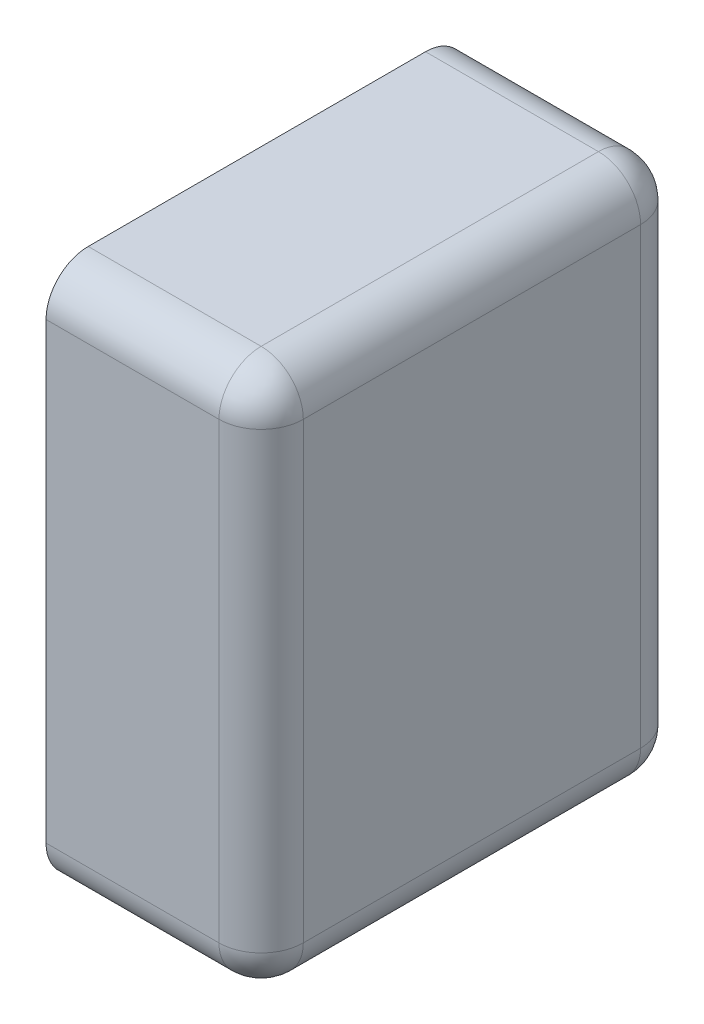
ISO-10303-21;
HEADER;
FILE_DESCRIPTION(('STEP AP214'),'2;1');
FILE_NAME('part.step','',(''),(''),'','','');
FILE_SCHEMA(('AUTOMOTIVE_DESIGN { 1 0 10303 214 1 1 1 1 }'));
ENDSEC;
DATA;
#1=APPLICATION_CONTEXT('core data for automotive mechanical design processes');
#2=APPLICATION_PROTOCOL_DEFINITION('international standard','automotive_design',2000,#1);
#3=PRODUCT_CONTEXT('',#1,'mechanical');
#4=PRODUCT('Part','Part','',(#3));
#5=PRODUCT_RELATED_PRODUCT_CATEGORY('part','',(#4));
#6=PRODUCT_DEFINITION_FORMATION('','',#4);
#7=PRODUCT_DEFINITION_CONTEXT('part definition',#1,'design');
#8=PRODUCT_DEFINITION('design','',#6,#7);
#9=PRODUCT_DEFINITION_SHAPE('','',#8);
#10=(LENGTH_UNIT() NAMED_UNIT(*) SI_UNIT(.MILLI.,.METRE.));
#11=(NAMED_UNIT(*) PLANE_ANGLE_UNIT() SI_UNIT($,.RADIAN.));
#12=(NAMED_UNIT(*) SI_UNIT($,.STERADIAN.) SOLID_ANGLE_UNIT());
#13=UNCERTAINTY_MEASURE_WITH_UNIT(LENGTH_MEASURE(1.E-05),#10,'distance_accuracy_value','');
#14=(GEOMETRIC_REPRESENTATION_CONTEXT(3) GLOBAL_UNCERTAINTY_ASSIGNED_CONTEXT((#13)) GLOBAL_UNIT_ASSIGNED_CONTEXT((#10,
#11,#12)) REPRESENTATION_CONTEXT('',''));
#15=CARTESIAN_POINT('',(0.,0.,0.));
#16=DIRECTION('',(0.,0.,1.));
#17=DIRECTION('',(1.,0.,0.));
#18=AXIS2_PLACEMENT_3D('',#15,#16,#17);
#19=CARTESIAN_POINT('',(0.5,-0.625,0.));
#20=DIRECTION('',(1.,0.,0.));
#21=DIRECTION('',(0.,0.,1.));
#22=AXIS2_PLACEMENT_3D('',#19,#20,#21);
#23=PLANE('',#22);
#24=CARTESIAN_POINT('',(0.5,-0.527,0.882));
#25=DIRECTION('',(-1.,0.,0.));
#26=DIRECTION('',(0.,0.,1.));
#27=AXIS2_PLACEMENT_3D('',#24,#25,#26);
#28=CIRCLE('',#27,0.098);
#29=CARTESIAN_POINT('',(0.5,-0.625,0.882));
#30=VERTEX_POINT('',#29);
#31=CARTESIAN_POINT('',(0.5,-0.527,0.98));
#32=VERTEX_POINT('',#31);
#33=EDGE_CURVE('E11',#30,#32,#28,.T.);
#34=ORIENTED_EDGE('',*,*,#33,.T.);
#35=DIRECTION('',(0.,1.,0.));
#36=VECTOR('',#35,1.);
#37=CARTESIAN_POINT('',(0.5,-0.625,0.98));
#38=LINE('',#37,#36);
#39=CARTESIAN_POINT('',(0.5,0.527,0.98));
#40=VERTEX_POINT('',#39);
#41=EDGE_CURVE('E24',#32,#40,#38,.T.);
#42=ORIENTED_EDGE('',*,*,#41,.T.);
#43=CARTESIAN_POINT('',(0.5,0.527,0.882));
#44=DIRECTION('',(1.,0.,0.));
#45=DIRECTION('',(0.,0.,1.));
#46=AXIS2_PLACEMENT_3D('',#43,#44,#45);
#47=CIRCLE('',#46,0.098);
#48=CARTESIAN_POINT('',(0.5,0.625,0.882));
#49=VERTEX_POINT('',#48);
#50=EDGE_CURVE('E195',#49,#40,#47,.T.);
#51=ORIENTED_EDGE('',*,*,#50,.F.);
#52=DIRECTION('',(0.,0.,1.));
#53=VECTOR('',#52,1.);
#54=CARTESIAN_POINT('',(0.5,0.625,0.));
#55=LINE('',#54,#53);
#56=CARTESIAN_POINT('',(0.5,0.625,0.098));
#57=VERTEX_POINT('',#56);
#58=EDGE_CURVE('E193',#57,#49,#55,.T.);
#59=ORIENTED_EDGE('',*,*,#58,.F.);
#60=CARTESIAN_POINT('',(0.5,0.527,0.098));
#61=DIRECTION('',(-1.,0.,0.));
#62=DIRECTION('',(0.,0.,1.));
#63=AXIS2_PLACEMENT_3D('',#60,#61,#62);
#64=CIRCLE('',#63,0.098);
#65=CARTESIAN_POINT('',(0.5,0.527,0.));
#66=VERTEX_POINT('',#65);
#67=EDGE_CURVE('E190',#57,#66,#64,.T.);
#68=ORIENTED_EDGE('',*,*,#67,.T.);
#69=DIRECTION('',(0.,1.,0.));
#70=VECTOR('',#69,1.);
#71=CARTESIAN_POINT('',(0.5,-0.625,0.));
#72=LINE('',#71,#70);
#73=CARTESIAN_POINT('',(0.5,-0.527,0.));
#74=VERTEX_POINT('',#73);
#75=EDGE_CURVE('E188',#74,#66,#72,.T.);
#76=ORIENTED_EDGE('',*,*,#75,.F.);
#77=CARTESIAN_POINT('',(0.5,-0.527,0.098));
#78=DIRECTION('',(1.,0.,0.));
#79=DIRECTION('',(0.,0.,1.));
#80=AXIS2_PLACEMENT_3D('',#77,#78,#79);
#81=CIRCLE('',#80,0.098);
#82=CARTESIAN_POINT('',(0.5,-0.625,0.098));
#83=VERTEX_POINT('',#82);
#84=EDGE_CURVE('E186',#83,#74,#81,.T.);
#85=ORIENTED_EDGE('',*,*,#84,.F.);
#86=DIRECTION('',(0.,0.,1.));
#87=VECTOR('',#86,1.);
#88=CARTESIAN_POINT('',(0.5,-0.625,0.));
#89=LINE('',#88,#87);
#90=EDGE_CURVE('E36',#83,#30,#89,.T.);
#91=ORIENTED_EDGE('',*,*,#90,.T.);
#92=EDGE_LOOP('',(#34,#42,#51,#59,#68,#76,#85,#91));
#93=FACE_BOUND('',#92,.T.);
#94=ADVANCED_FACE('F17',(#93),#23,.F.);
#95=CARTESIAN_POINT('',(0.5,-0.625,0.));
#96=DIRECTION('',(0.,1.,0.));
#97=DIRECTION('',(0.,0.,1.));
#98=AXIS2_PLACEMENT_3D('',#95,#96,#97);
#99=PLANE('',#98);
#100=DIRECTION('',(1.,0.,0.));
#101=VECTOR('',#100,1.);
#102=CARTESIAN_POINT('',(0.5,-0.625,0.098));
#103=LINE('',#102,#101);
#104=CARTESIAN_POINT('',(0.902,-0.625,0.098));
#105=VERTEX_POINT('',#104);
#106=EDGE_CURVE('E182',#83,#105,#103,.T.);
#107=ORIENTED_EDGE('',*,*,#106,.T.);
#108=DIRECTION('',(0.,0.,1.));
#109=VECTOR('',#108,1.);
#110=CARTESIAN_POINT('',(0.902,-0.625,0.));
#111=LINE('',#110,#109);
#112=CARTESIAN_POINT('',(0.902,-0.625,0.882));
#113=VERTEX_POINT('',#112);
#114=EDGE_CURVE('E179',#105,#113,#111,.T.);
#115=ORIENTED_EDGE('',*,*,#114,.T.);
#116=DIRECTION('',(1.,0.,0.));
#117=VECTOR('',#116,1.);
#118=CARTESIAN_POINT('',(0.5,-0.625,0.882));
#119=LINE('',#118,#117);
#120=EDGE_CURVE('E177',#30,#113,#119,.T.);
#121=ORIENTED_EDGE('',*,*,#120,.F.);
#122=ORIENTED_EDGE('',*,*,#90,.F.);
#123=EDGE_LOOP('',(#107,#115,#121,#122));
#124=FACE_BOUND('',#123,.T.);
#125=ADVANCED_FACE('F227',(#124),#99,.F.);
#126=CARTESIAN_POINT('',(0.5,-0.527,0.098));
#127=DIRECTION('',(1.,0.,0.));
#128=DIRECTION('',(0.,-1.,0.));
#129=AXIS2_PLACEMENT_3D('',#126,#127,#128);
#130=CYLINDRICAL_SURFACE('',#129,0.098);
#131=ORIENTED_EDGE('',*,*,#84,.T.);
#132=DIRECTION('',(1.,0.,0.));
#133=VECTOR('',#132,1.);
#134=CARTESIAN_POINT('',(0.5,-0.527,0.));
#135=LINE('',#134,#133);
#136=CARTESIAN_POINT('',(0.902,-0.527,0.));
#137=VERTEX_POINT('',#136);
#138=EDGE_CURVE('E175',#74,#137,#135,.T.);
#139=ORIENTED_EDGE('',*,*,#138,.T.);
#140=CARTESIAN_POINT('',(0.902,-0.527,0.098));
#141=DIRECTION('',(-1.,0.,0.));
#142=DIRECTION('',(0.,-1.,0.));
#143=AXIS2_PLACEMENT_3D('',#140,#141,#142);
#144=CIRCLE('',#143,0.098);
#145=EDGE_CURVE('E172',#137,#105,#144,.T.);
#146=ORIENTED_EDGE('',*,*,#145,.T.);
#147=ORIENTED_EDGE('',*,*,#106,.F.);
#148=EDGE_LOOP('',(#131,#139,#146,#147));
#149=FACE_BOUND('',#148,.T.);
#150=ADVANCED_FACE('F219',(#149),#130,.T.);
#151=CARTESIAN_POINT('',(0.5,-0.527,0.882));
#152=DIRECTION('',(1.,0.,0.));
#153=DIRECTION('',(0.,-1.,0.));
#154=AXIS2_PLACEMENT_3D('',#151,#152,#153);
#155=CYLINDRICAL_SURFACE('',#154,0.098);
#156=ORIENTED_EDGE('',*,*,#120,.T.);
#157=CARTESIAN_POINT('',(0.902,-0.527,0.882));
#158=DIRECTION('',(1.,0.,0.));
#159=DIRECTION('',(0.,-1.,0.));
#160=AXIS2_PLACEMENT_3D('',#157,#158,#159);
#161=CIRCLE('',#160,0.098);
#162=CARTESIAN_POINT('',(0.902,-0.527,0.98));
#163=VERTEX_POINT('',#162);
#164=EDGE_CURVE('E169',#163,#113,#161,.T.);
#165=ORIENTED_EDGE('',*,*,#164,.F.);
#166=DIRECTION('',(1.,0.,0.));
#167=VECTOR('',#166,1.);
#168=CARTESIAN_POINT('',(0.5,-0.527,0.98));
#169=LINE('',#168,#167);
#170=EDGE_CURVE('E167',#32,#163,#169,.T.);
#171=ORIENTED_EDGE('',*,*,#170,.F.);
#172=ORIENTED_EDGE('',*,*,#33,.F.);
#173=EDGE_LOOP('',(#156,#165,#171,#172));
#174=FACE_BOUND('',#173,.T.);
#175=ADVANCED_FACE('F229',(#174),#155,.T.);
#176=CARTESIAN_POINT('',(0.5,-0.625,0.));
#177=DIRECTION('',(0.,0.,1.));
#178=DIRECTION('',(1.,0.,0.));
#179=AXIS2_PLACEMENT_3D('',#176,#177,#178);
#180=PLANE('',#179);
#181=DIRECTION('',(1.,0.,0.));
#182=VECTOR('',#181,1.);
#183=CARTESIAN_POINT('',(0.5,0.527,0.));
#184=LINE('',#183,#182);
#185=CARTESIAN_POINT('',(0.902,0.527,0.));
#186=VERTEX_POINT('',#185);
#187=EDGE_CURVE('E164',#66,#186,#184,.T.);
#188=ORIENTED_EDGE('',*,*,#187,.T.);
#189=DIRECTION('',(0.,1.,0.));
#190=VECTOR('',#189,1.);
#191=CARTESIAN_POINT('',(0.902,-0.625,0.));
#192=LINE('',#191,#190);
#193=EDGE_CURVE('E162',#137,#186,#192,.T.);
#194=ORIENTED_EDGE('',*,*,#193,.F.);
#195=ORIENTED_EDGE('',*,*,#138,.F.);
#196=ORIENTED_EDGE('',*,*,#75,.T.);
#197=EDGE_LOOP('',(#188,#194,#195,#196));
#198=FACE_BOUND('',#197,.T.);
#199=ADVANCED_FACE('F215',(#198),#180,.F.);
#200=CARTESIAN_POINT('',(0.5,-0.625,0.98));
#201=DIRECTION('',(0.,0.,1.));
#202=DIRECTION('',(1.,0.,0.));
#203=AXIS2_PLACEMENT_3D('',#200,#201,#202);
#204=PLANE('',#203);
#205=ORIENTED_EDGE('',*,*,#41,.F.);
#206=ORIENTED_EDGE('',*,*,#170,.T.);
#207=DIRECTION('',(0.,1.,0.));
#208=VECTOR('',#207,1.);
#209=CARTESIAN_POINT('',(0.902,-0.625,0.98));
#210=LINE('',#209,#208);
#211=CARTESIAN_POINT('',(0.902,0.527,0.98));
#212=VERTEX_POINT('',#211);
#213=EDGE_CURVE('E160',#163,#212,#210,.T.);
#214=ORIENTED_EDGE('',*,*,#213,.T.);
#215=DIRECTION('',(1.,0.,0.));
#216=VECTOR('',#215,1.);
#217=CARTESIAN_POINT('',(0.5,0.527,0.98));
#218=LINE('',#217,#216);
#219=EDGE_CURVE('E157',#40,#212,#218,.T.);
#220=ORIENTED_EDGE('',*,*,#219,.F.);
#221=EDGE_LOOP('',(#205,#206,#214,#220));
#222=FACE_BOUND('',#221,.T.);
#223=ADVANCED_FACE('F200',(#222),#204,.T.);
#224=CARTESIAN_POINT('',(0.5,0.527,0.098));
#225=DIRECTION('',(1.,0.,0.));
#226=DIRECTION('',(0.,1.,0.));
#227=AXIS2_PLACEMENT_3D('',#224,#225,#226);
#228=CYLINDRICAL_SURFACE('',#227,0.098);
#229=DIRECTION('',(1.,0.,0.));
#230=VECTOR('',#229,1.);
#231=CARTESIAN_POINT('',(0.5,0.625,0.098));
#232=LINE('',#231,#230);
#233=CARTESIAN_POINT('',(0.902,0.625,0.098));
#234=VERTEX_POINT('',#233);
#235=EDGE_CURVE('E155',#57,#234,#232,.T.);
#236=ORIENTED_EDGE('',*,*,#235,.T.);
#237=CARTESIAN_POINT('',(0.902,0.527,0.098));
#238=DIRECTION('',(1.,0.,0.));
#239=DIRECTION('',(0.,1.,0.));
#240=AXIS2_PLACEMENT_3D('',#237,#238,#239);
#241=CIRCLE('',#240,0.098);
#242=EDGE_CURVE('E152',#186,#234,#241,.T.);
#243=ORIENTED_EDGE('',*,*,#242,.F.);
#244=ORIENTED_EDGE('',*,*,#187,.F.);
#245=ORIENTED_EDGE('',*,*,#67,.F.);
#246=EDGE_LOOP('',(#236,#243,#244,#245));
#247=FACE_BOUND('',#246,.T.);
#248=ADVANCED_FACE('F211',(#247),#228,.T.);
#249=CARTESIAN_POINT('',(0.5,0.527,0.882));
#250=DIRECTION('',(1.,0.,0.));
#251=DIRECTION('',(0.,1.,0.));
#252=AXIS2_PLACEMENT_3D('',#249,#250,#251);
#253=CYLINDRICAL_SURFACE('',#252,0.098);
#254=ORIENTED_EDGE('',*,*,#50,.T.);
#255=ORIENTED_EDGE('',*,*,#219,.T.);
#256=CARTESIAN_POINT('',(0.902,0.527,0.882));
#257=DIRECTION('',(1.,0.,0.));
#258=DIRECTION('',(0.,0.,1.));
#259=AXIS2_PLACEMENT_3D('',#256,#257,#258);
#260=CIRCLE('',#259,0.098);
#261=CARTESIAN_POINT('',(0.902,0.625,0.882));
#262=VERTEX_POINT('',#261);
#263=EDGE_CURVE('E112',#262,#212,#260,.T.);
#264=ORIENTED_EDGE('',*,*,#263,.F.);
#265=DIRECTION('',(1.,0.,0.));
#266=VECTOR('',#265,1.);
#267=CARTESIAN_POINT('',(0.5,0.625,0.882));
#268=LINE('',#267,#266);
#269=EDGE_CURVE('E148',#49,#262,#268,.T.);
#270=ORIENTED_EDGE('',*,*,#269,.F.);
#271=EDGE_LOOP('',(#254,#255,#264,#270));
#272=FACE_BOUND('',#271,.T.);
#273=ADVANCED_FACE('F202',(#272),#253,.T.);
#274=CARTESIAN_POINT('',(0.5,0.625,0.));
#275=DIRECTION('',(0.,1.,0.));
#276=DIRECTION('',(0.,0.,1.));
#277=AXIS2_PLACEMENT_3D('',#274,#275,#276);
#278=PLANE('',#277);
#279=ORIENTED_EDGE('',*,*,#58,.T.);
#280=ORIENTED_EDGE('',*,*,#269,.T.);
#281=DIRECTION('',(0.,0.,1.));
#282=VECTOR('',#281,1.);
#283=CARTESIAN_POINT('',(0.902,0.625,0.));
#284=LINE('',#283,#282);
#285=EDGE_CURVE('E122',#234,#262,#284,.T.);
#286=ORIENTED_EDGE('',*,*,#285,.F.);
#287=ORIENTED_EDGE('',*,*,#235,.F.);
#288=EDGE_LOOP('',(#279,#280,#286,#287));
#289=FACE_BOUND('',#288,.T.);
#290=ADVANCED_FACE('F204',(#289),#278,.T.);
#291=CARTESIAN_POINT('',(0.902,-0.527,0.));
#292=DIRECTION('',(0.,0.,1.));
#293=DIRECTION('',(1.,0.,0.));
#294=AXIS2_PLACEMENT_3D('',#291,#292,#293);
#295=CYLINDRICAL_SURFACE('',#294,0.098);
#296=CARTESIAN_POINT('',(0.902,-0.527,0.882));
#297=DIRECTION('',(0.,0.,-1.));
#298=DIRECTION('',(1.,0.,0.));
#299=AXIS2_PLACEMENT_3D('',#296,#297,#298);
#300=CIRCLE('',#299,0.098);
#301=CARTESIAN_POINT('',(1.,-0.527,0.882));
#302=VERTEX_POINT('',#301);
#303=EDGE_CURVE('E144',#302,#113,#300,.T.);
#304=ORIENTED_EDGE('',*,*,#303,.T.);
#305=ORIENTED_EDGE('',*,*,#114,.F.);
#306=CARTESIAN_POINT('',(0.902,-0.527,0.098));
#307=DIRECTION('',(0.,0.,-1.));
#308=DIRECTION('',(1.,0.,0.));
#309=AXIS2_PLACEMENT_3D('',#306,#307,#308);
#310=CIRCLE('',#309,0.098);
#311=CARTESIAN_POINT('',(1.,-0.527,0.098));
#312=VERTEX_POINT('',#311);
#313=EDGE_CURVE('E141',#312,#105,#310,.T.);
#314=ORIENTED_EDGE('',*,*,#313,.F.);
#315=DIRECTION('',(0.,0.,1.));
#316=VECTOR('',#315,1.);
#317=CARTESIAN_POINT('',(1.,-0.527,0.));
#318=LINE('',#317,#316);
#319=EDGE_CURVE('E138',#312,#302,#318,.T.);
#320=ORIENTED_EDGE('',*,*,#319,.T.);
#321=EDGE_LOOP('',(#304,#305,#314,#320));
#322=FACE_BOUND('',#321,.T.);
#323=ADVANCED_FACE('F224',(#322),#295,.T.);
#324=CARTESIAN_POINT('',(0.902,-0.527,0.098));
#325=DIRECTION('',(0.,0.,1.));
#326=DIRECTION('',(1.,0.,0.));
#327=AXIS2_PLACEMENT_3D('',#324,#325,#326);
#328=SPHERICAL_SURFACE('',#327,0.098);
#329=ORIENTED_EDGE('',*,*,#313,.T.);
#330=ORIENTED_EDGE('',*,*,#145,.F.);
#331=CARTESIAN_POINT('',(0.902,-0.527,0.098));
#332=DIRECTION('',(0.,-1.,0.));
#333=DIRECTION('',(1.,0.,0.));
#334=AXIS2_PLACEMENT_3D('',#331,#332,#333);
#335=CIRCLE('',#334,0.098);
#336=EDGE_CURVE('E135',#137,#312,#335,.T.);
#337=ORIENTED_EDGE('',*,*,#336,.T.);
#338=EDGE_LOOP('',(#329,#330,#337));
#339=FACE_BOUND('',#338,.T.);
#340=ADVANCED_FACE('F222',(#339),#328,.T.);
#341=CARTESIAN_POINT('',(0.902,-0.527,0.882));
#342=DIRECTION('',(0.,0.,-1.));
#343=DIRECTION('',(1.,0.,0.));
#344=AXIS2_PLACEMENT_3D('',#341,#342,#343);
#345=SPHERICAL_SURFACE('',#344,0.098);
#346=CARTESIAN_POINT('',(0.902,-0.527,0.882));
#347=DIRECTION('',(0.,1.,0.));
#348=DIRECTION('',(1.,0.,0.));
#349=AXIS2_PLACEMENT_3D('',#346,#347,#348);
#350=CIRCLE('',#349,0.098);
#351=EDGE_CURVE('E100',#163,#302,#350,.T.);
#352=ORIENTED_EDGE('',*,*,#351,.F.);
#353=ORIENTED_EDGE('',*,*,#164,.T.);
#354=ORIENTED_EDGE('',*,*,#303,.F.);
#355=EDGE_LOOP('',(#352,#353,#354));
#356=FACE_BOUND('',#355,.T.);
#357=ADVANCED_FACE('F231',(#356),#345,.T.);
#358=CARTESIAN_POINT('',(0.902,-0.625,0.098));
#359=DIRECTION('',(0.,1.,0.));
#360=DIRECTION('',(1.,0.,0.));
#361=AXIS2_PLACEMENT_3D('',#358,#359,#360);
#362=CYLINDRICAL_SURFACE('',#361,0.098);
#363=ORIENTED_EDGE('',*,*,#336,.F.);
#364=ORIENTED_EDGE('',*,*,#193,.T.);
#365=CARTESIAN_POINT('',(0.902,0.527,0.098));
#366=DIRECTION('',(0.,-1.,0.));
#367=DIRECTION('',(1.,0.,0.));
#368=AXIS2_PLACEMENT_3D('',#365,#366,#367);
#369=CIRCLE('',#368,0.098);
#370=CARTESIAN_POINT('',(1.,0.527,0.098));
#371=VERTEX_POINT('',#370);
#372=EDGE_CURVE('E132',#186,#371,#369,.T.);
#373=ORIENTED_EDGE('',*,*,#372,.T.);
#374=DIRECTION('',(0.,1.,0.));
#375=VECTOR('',#374,1.);
#376=CARTESIAN_POINT('',(1.,-0.625,0.098));
#377=LINE('',#376,#375);
#378=EDGE_CURVE('E104',#312,#371,#377,.T.);
#379=ORIENTED_EDGE('',*,*,#378,.F.);
#380=EDGE_LOOP('',(#363,#364,#373,#379));
#381=FACE_BOUND('',#380,.T.);
#382=ADVANCED_FACE('F233',(#381),#362,.T.);
#383=CARTESIAN_POINT('',(0.902,-0.625,0.882));
#384=DIRECTION('',(0.,1.,0.));
#385=DIRECTION('',(1.,0.,0.));
#386=AXIS2_PLACEMENT_3D('',#383,#384,#385);
#387=CYLINDRICAL_SURFACE('',#386,0.098);
#388=DIRECTION('',(0.,1.,0.));
#389=VECTOR('',#388,1.);
#390=CARTESIAN_POINT('',(1.,-0.625,0.882));
#391=LINE('',#390,#389);
#392=CARTESIAN_POINT('',(1.,0.527,0.882));
#393=VERTEX_POINT('',#392);
#394=EDGE_CURVE('E94',#302,#393,#391,.T.);
#395=ORIENTED_EDGE('',*,*,#394,.T.);
#396=CARTESIAN_POINT('',(0.902,0.527,0.882));
#397=DIRECTION('',(0.,-1.,0.));
#398=DIRECTION('',(1.,0.,0.));
#399=AXIS2_PLACEMENT_3D('',#396,#397,#398);
#400=CIRCLE('',#399,0.098);
#401=EDGE_CURVE('E98',#393,#212,#400,.T.);
#402=ORIENTED_EDGE('',*,*,#401,.T.);
#403=ORIENTED_EDGE('',*,*,#213,.F.);
#404=ORIENTED_EDGE('',*,*,#351,.T.);
#405=EDGE_LOOP('',(#395,#402,#403,#404));
#406=FACE_BOUND('',#405,.T.);
#407=ADVANCED_FACE('F96',(#406),#387,.T.);
#408=CARTESIAN_POINT('',(0.902,0.527,0.098));
#409=DIRECTION('',(0.,0.,1.));
#410=DIRECTION('',(1.,0.,0.));
#411=AXIS2_PLACEMENT_3D('',#408,#409,#410);
#412=SPHERICAL_SURFACE('',#411,0.098);
#413=ORIENTED_EDGE('',*,*,#372,.F.);
#414=ORIENTED_EDGE('',*,*,#242,.T.);
#415=CARTESIAN_POINT('',(0.902,0.527,0.098));
#416=DIRECTION('',(0.,0.,1.));
#417=DIRECTION('',(1.,0.,0.));
#418=AXIS2_PLACEMENT_3D('',#415,#416,#417);
#419=CIRCLE('',#418,0.098);
#420=EDGE_CURVE('E113',#371,#234,#419,.T.);
#421=ORIENTED_EDGE('',*,*,#420,.F.);
#422=EDGE_LOOP('',(#413,#414,#421));
#423=FACE_BOUND('',#422,.T.);
#424=ADVANCED_FACE('F300',(#423),#412,.T.);
#425=CARTESIAN_POINT('',(0.902,0.527,0.882));
#426=DIRECTION('',(0.,-1.,0.));
#427=DIRECTION('',(1.,0.,0.));
#428=AXIS2_PLACEMENT_3D('',#425,#426,#427);
#429=SPHERICAL_SURFACE('',#428,0.098);
#430=CARTESIAN_POINT('',(0.902,0.527,0.882));
#431=DIRECTION('',(0.,0.,-1.));
#432=DIRECTION('',(1.,0.,0.));
#433=AXIS2_PLACEMENT_3D('',#430,#431,#432);
#434=CIRCLE('',#433,0.098);
#435=EDGE_CURVE('E111',#262,#393,#434,.T.);
#436=ORIENTED_EDGE('',*,*,#435,.F.);
#437=ORIENTED_EDGE('',*,*,#263,.T.);
#438=ORIENTED_EDGE('',*,*,#401,.F.);
#439=EDGE_LOOP('',(#436,#437,#438));
#440=FACE_BOUND('',#439,.T.);
#441=ADVANCED_FACE('F110',(#440),#429,.T.);
#442=CARTESIAN_POINT('',(0.902,0.527,0.));
#443=DIRECTION('',(0.,0.,1.));
#444=DIRECTION('',(1.,0.,0.));
#445=AXIS2_PLACEMENT_3D('',#442,#443,#444);
#446=CYLINDRICAL_SURFACE('',#445,0.098);
#447=DIRECTION('',(0.,0.,1.));
#448=VECTOR('',#447,1.);
#449=CARTESIAN_POINT('',(1.,0.527,0.));
#450=LINE('',#449,#448);
#451=EDGE_CURVE('E120',#371,#393,#450,.T.);
#452=ORIENTED_EDGE('',*,*,#451,.F.);
#453=ORIENTED_EDGE('',*,*,#420,.T.);
#454=ORIENTED_EDGE('',*,*,#285,.T.);
#455=ORIENTED_EDGE('',*,*,#435,.T.);
#456=EDGE_LOOP('',(#452,#453,#454,#455));
#457=FACE_BOUND('',#456,.T.);
#458=ADVANCED_FACE('F118',(#457),#446,.T.);
#459=CARTESIAN_POINT('',(1.,-0.625,0.));
#460=DIRECTION('',(1.,0.,0.));
#461=DIRECTION('',(0.,0.,1.));
#462=AXIS2_PLACEMENT_3D('',#459,#460,#461);
#463=PLANE('',#462);
#464=ORIENTED_EDGE('',*,*,#319,.F.);
#465=ORIENTED_EDGE('',*,*,#378,.T.);
#466=ORIENTED_EDGE('',*,*,#451,.T.);
#467=ORIENTED_EDGE('',*,*,#394,.F.);
#468=EDGE_LOOP('',(#464,#465,#466,#467));
#469=FACE_BOUND('',#468,.T.);
#470=ADVANCED_FACE('F125',(#469),#463,.T.);
#471=CLOSED_SHELL('',(#94,#125,#150,#175,#199,#223,#248,#273,#290,#323,#340,#357,#382,#407,#424,
#441,#458,#470));
#472=MANIFOLD_SOLID_BREP('B1',#471);
#473=ADVANCED_BREP_SHAPE_REPRESENTATION('',(#18,#472),#14);
#474=SHAPE_DEFINITION_REPRESENTATION(#9,#473);
ENDSEC;
END-ISO-10303-21;
